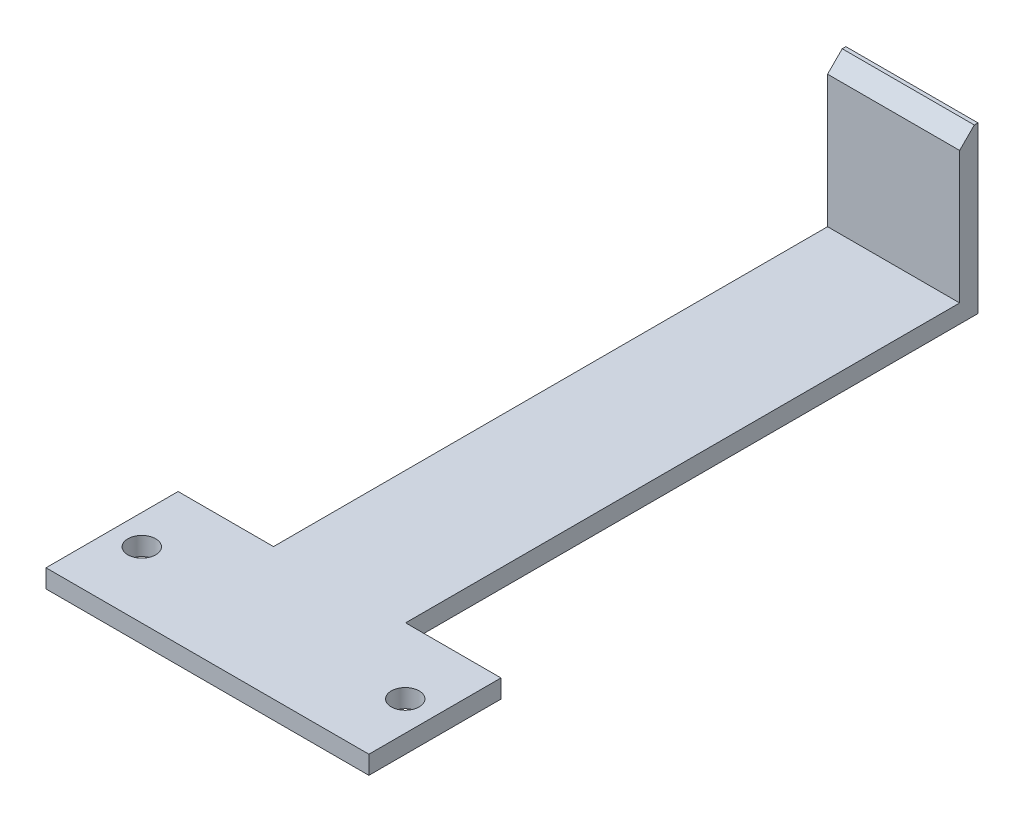
ISO-10303-21;
HEADER;
FILE_DESCRIPTION(('STEP AP214'),'2;1');
FILE_NAME('part.step','',(''),(''),'','','');
FILE_SCHEMA(('AUTOMOTIVE_DESIGN { 1 0 10303 214 1 1 1 1 }'));
ENDSEC;
DATA;
#1=APPLICATION_CONTEXT('core data for automotive mechanical design processes');
#2=APPLICATION_PROTOCOL_DEFINITION('international standard','automotive_design',2000,#1);
#3=PRODUCT_CONTEXT('',#1,'mechanical');
#4=PRODUCT('Part','Part','',(#3));
#5=PRODUCT_RELATED_PRODUCT_CATEGORY('part','',(#4));
#6=PRODUCT_DEFINITION_FORMATION('','',#4);
#7=PRODUCT_DEFINITION_CONTEXT('part definition',#1,'design');
#8=PRODUCT_DEFINITION('design','',#6,#7);
#9=PRODUCT_DEFINITION_SHAPE('','',#8);
#10=(LENGTH_UNIT() NAMED_UNIT(*) SI_UNIT(.MILLI.,.METRE.));
#11=(NAMED_UNIT(*) PLANE_ANGLE_UNIT() SI_UNIT($,.RADIAN.));
#12=(NAMED_UNIT(*) SI_UNIT($,.STERADIAN.) SOLID_ANGLE_UNIT());
#13=UNCERTAINTY_MEASURE_WITH_UNIT(LENGTH_MEASURE(1.E-05),#10,'distance_accuracy_value','');
#14=(GEOMETRIC_REPRESENTATION_CONTEXT(3) GLOBAL_UNCERTAINTY_ASSIGNED_CONTEXT((#13)) GLOBAL_UNIT_ASSIGNED_CONTEXT((#10,
#11,#12)) REPRESENTATION_CONTEXT('',''));
#15=CARTESIAN_POINT('',(0.,0.,0.));
#16=DIRECTION('',(0.,0.,1.));
#17=DIRECTION('',(1.,0.,0.));
#18=AXIS2_PLACEMENT_3D('',#15,#16,#17);
#19=CARTESIAN_POINT('',(-11.43,3.175,0.));
#20=DIRECTION('',(-1.,0.,0.));
#21=DIRECTION('',(0.,0.,1.));
#22=AXIS2_PLACEMENT_3D('',#19,#20,#21);
#23=PLANE('',#22);
#24=DIRECTION('',(0.,-1.,0.));
#25=VECTOR('',#24,1.);
#26=CARTESIAN_POINT('',(-11.43,28.575,-107.315));
#27=LINE('',#26,#25);
#28=CARTESIAN_POINT('',(-11.43,26.035,-107.315));
#29=VERTEX_POINT('',#28);
#30=CARTESIAN_POINT('',(-11.43,3.175,-107.315));
#31=VERTEX_POINT('',#30);
#32=EDGE_CURVE('E165',#29,#31,#27,.T.);
#33=ORIENTED_EDGE('',*,*,#32,.F.);
#34=DIRECTION('',(0.,0.707106781186551,-0.707106781186544));
#35=VECTOR('',#34,1.);
#36=CARTESIAN_POINT('',(-11.43,-39.0525000000001,-42.2275000000006));
#37=LINE('',#36,#35);
#38=CARTESIAN_POINT('',(-11.43,28.575,-109.855));
#39=VERTEX_POINT('',#38);
#40=EDGE_CURVE('E13',#29,#39,#37,.T.);
#41=ORIENTED_EDGE('',*,*,#40,.T.);
#42=DIRECTION('',(0.,0.,1.));
#43=VECTOR('',#42,1.);
#44=CARTESIAN_POINT('',(-11.43,28.575,-110.49));
#45=LINE('',#44,#43);
#46=CARTESIAN_POINT('',(-11.43,28.575,-110.49));
#47=VERTEX_POINT('',#46);
#48=EDGE_CURVE('E145',#47,#39,#45,.T.);
#49=ORIENTED_EDGE('',*,*,#48,.F.);
#50=DIRECTION('',(0.,-1.,0.));
#51=VECTOR('',#50,1.);
#52=CARTESIAN_POINT('',(-11.43,3.175,-110.49));
#53=LINE('',#52,#51);
#54=CARTESIAN_POINT('',(-11.43,0.,-110.49));
#55=VERTEX_POINT('',#54);
#56=EDGE_CURVE('E158',#47,#55,#53,.T.);
#57=ORIENTED_EDGE('',*,*,#56,.T.);
#58=DIRECTION('',(0.,0.,-1.));
#59=VECTOR('',#58,1.);
#60=CARTESIAN_POINT('',(-11.43,0.,0.));
#61=LINE('',#60,#59);
#62=CARTESIAN_POINT('',(-11.43,0.,-11.43));
#63=VERTEX_POINT('',#62);
#64=EDGE_CURVE('E175',#63,#55,#61,.T.);
#65=ORIENTED_EDGE('',*,*,#64,.F.);
#66=DIRECTION('',(0.,-1.,0.));
#67=VECTOR('',#66,1.);
#68=CARTESIAN_POINT('',(-11.43,3.175,-11.43));
#69=LINE('',#68,#67);
#70=CARTESIAN_POINT('',(-11.43,3.175,-11.43));
#71=VERTEX_POINT('',#70);
#72=EDGE_CURVE('E256',#71,#63,#69,.T.);
#73=ORIENTED_EDGE('',*,*,#72,.F.);
#74=DIRECTION('',(0.,0.,-1.));
#75=VECTOR('',#74,1.);
#76=CARTESIAN_POINT('',(-11.43,3.175,0.));
#77=LINE('',#76,#75);
#78=EDGE_CURVE('E176',#71,#31,#77,.T.);
#79=ORIENTED_EDGE('',*,*,#78,.T.);
#80=EDGE_LOOP('',(#33,#41,#49,#57,#65,#73,#79));
#81=FACE_BOUND('',#80,.T.);
#82=ADVANCED_FACE('F52',(#81),#23,.T.);
#83=CARTESIAN_POINT('',(0.,3.175,-11.43));
#84=DIRECTION('',(0.,0.,1.));
#85=DIRECTION('',(1.,0.,0.));
#86=AXIS2_PLACEMENT_3D('',#83,#84,#85);
#87=PLANE('',#86);
#88=DIRECTION('',(-1.,0.,0.));
#89=VECTOR('',#88,1.);
#90=CARTESIAN_POINT('',(0.,0.,-11.43));
#91=LINE('',#90,#89);
#92=CARTESIAN_POINT('',(-27.94,0.,-11.43));
#93=VERTEX_POINT('',#92);
#94=EDGE_CURVE('E211',#63,#93,#91,.T.);
#95=ORIENTED_EDGE('',*,*,#94,.T.);
#96=DIRECTION('',(0.,-1.,0.));
#97=VECTOR('',#96,1.);
#98=CARTESIAN_POINT('',(-27.94,3.175,-11.43));
#99=LINE('',#98,#97);
#100=CARTESIAN_POINT('',(-27.94,3.175,-11.43));
#101=VERTEX_POINT('',#100);
#102=EDGE_CURVE('E253',#101,#93,#99,.T.);
#103=ORIENTED_EDGE('',*,*,#102,.F.);
#104=DIRECTION('',(-1.,0.,0.));
#105=VECTOR('',#104,1.);
#106=CARTESIAN_POINT('',(0.,3.175,-11.43));
#107=LINE('',#106,#105);
#108=EDGE_CURVE('E180',#71,#101,#107,.T.);
#109=ORIENTED_EDGE('',*,*,#108,.F.);
#110=ORIENTED_EDGE('',*,*,#72,.T.);
#111=EDGE_LOOP('',(#95,#103,#109,#110));
#112=FACE_BOUND('',#111,.T.);
#113=ADVANCED_FACE('F290',(#112),#87,.F.);
#114=CARTESIAN_POINT('',(-27.94,3.175,0.));
#115=DIRECTION('',(-1.,0.,0.));
#116=DIRECTION('',(0.,0.,1.));
#117=AXIS2_PLACEMENT_3D('',#114,#115,#116);
#118=PLANE('',#117);
#119=DIRECTION('',(0.,0.,-1.));
#120=VECTOR('',#119,1.);
#121=CARTESIAN_POINT('',(-27.94,0.,0.));
#122=LINE('',#121,#120);
#123=CARTESIAN_POINT('',(-27.94,0.,11.43));
#124=VERTEX_POINT('',#123);
#125=EDGE_CURVE('E215',#124,#93,#122,.T.);
#126=ORIENTED_EDGE('',*,*,#125,.F.);
#127=DIRECTION('',(0.,-1.,0.));
#128=VECTOR('',#127,1.);
#129=CARTESIAN_POINT('',(-27.94,3.175,11.43));
#130=LINE('',#129,#128);
#131=CARTESIAN_POINT('',(-27.94,3.175,11.43));
#132=VERTEX_POINT('',#131);
#133=EDGE_CURVE('E250',#132,#124,#130,.T.);
#134=ORIENTED_EDGE('',*,*,#133,.F.);
#135=DIRECTION('',(0.,0.,-1.));
#136=VECTOR('',#135,1.);
#137=CARTESIAN_POINT('',(-27.94,3.175,0.));
#138=LINE('',#137,#136);
#139=EDGE_CURVE('E184',#132,#101,#138,.T.);
#140=ORIENTED_EDGE('',*,*,#139,.T.);
#141=ORIENTED_EDGE('',*,*,#102,.T.);
#142=EDGE_LOOP('',(#126,#134,#140,#141));
#143=FACE_BOUND('',#142,.T.);
#144=ADVANCED_FACE('F294',(#143),#118,.T.);
#145=CARTESIAN_POINT('',(0.,3.175,11.43));
#146=DIRECTION('',(0.,0.,1.));
#147=DIRECTION('',(1.,0.,0.));
#148=AXIS2_PLACEMENT_3D('',#145,#146,#147);
#149=PLANE('',#148);
#150=DIRECTION('',(-1.,0.,0.));
#151=VECTOR('',#150,1.);
#152=CARTESIAN_POINT('',(0.,0.,11.43));
#153=LINE('',#152,#151);
#154=CARTESIAN_POINT('',(27.94,0.,11.43));
#155=VERTEX_POINT('',#154);
#156=EDGE_CURVE('E220',#155,#124,#153,.T.);
#157=ORIENTED_EDGE('',*,*,#156,.F.);
#158=DIRECTION('',(0.,-1.,0.));
#159=VECTOR('',#158,1.);
#160=CARTESIAN_POINT('',(27.94,3.175,11.43));
#161=LINE('',#160,#159);
#162=CARTESIAN_POINT('',(27.94,3.175,11.43));
#163=VERTEX_POINT('',#162);
#164=EDGE_CURVE('E247',#163,#155,#161,.T.);
#165=ORIENTED_EDGE('',*,*,#164,.F.);
#166=DIRECTION('',(-1.,0.,0.));
#167=VECTOR('',#166,1.);
#168=CARTESIAN_POINT('',(0.,3.175,11.43));
#169=LINE('',#168,#167);
#170=EDGE_CURVE('E189',#163,#132,#169,.T.);
#171=ORIENTED_EDGE('',*,*,#170,.T.);
#172=ORIENTED_EDGE('',*,*,#133,.T.);
#173=EDGE_LOOP('',(#157,#165,#171,#172));
#174=FACE_BOUND('',#173,.T.);
#175=ADVANCED_FACE('F300',(#174),#149,.T.);
#176=CARTESIAN_POINT('',(27.94,3.175,0.));
#177=DIRECTION('',(-1.,0.,0.));
#178=DIRECTION('',(0.,0.,1.));
#179=AXIS2_PLACEMENT_3D('',#176,#177,#178);
#180=PLANE('',#179);
#181=DIRECTION('',(0.,0.,-1.));
#182=VECTOR('',#181,1.);
#183=CARTESIAN_POINT('',(27.94,0.,0.));
#184=LINE('',#183,#182);
#185=CARTESIAN_POINT('',(27.94,0.,-11.43));
#186=VERTEX_POINT('',#185);
#187=EDGE_CURVE('E224',#155,#186,#184,.T.);
#188=ORIENTED_EDGE('',*,*,#187,.T.);
#189=DIRECTION('',(0.,-1.,0.));
#190=VECTOR('',#189,1.);
#191=CARTESIAN_POINT('',(27.94,3.175,-11.43));
#192=LINE('',#191,#190);
#193=CARTESIAN_POINT('',(27.94,3.175,-11.43));
#194=VERTEX_POINT('',#193);
#195=EDGE_CURVE('E243',#194,#186,#192,.T.);
#196=ORIENTED_EDGE('',*,*,#195,.F.);
#197=DIRECTION('',(0.,0.,-1.));
#198=VECTOR('',#197,1.);
#199=CARTESIAN_POINT('',(27.94,3.175,0.));
#200=LINE('',#199,#198);
#201=EDGE_CURVE('E193',#163,#194,#200,.T.);
#202=ORIENTED_EDGE('',*,*,#201,.F.);
#203=ORIENTED_EDGE('',*,*,#164,.T.);
#204=EDGE_LOOP('',(#188,#196,#202,#203));
#205=FACE_BOUND('',#204,.T.);
#206=ADVANCED_FACE('F304',(#205),#180,.F.);
#207=CARTESIAN_POINT('',(11.43,0.,-11.43));
#208=VERTEX_POINT('',#207);
#209=EDGE_CURVE('E216',#186,#208,#91,.T.);
#210=ORIENTED_EDGE('',*,*,#209,.T.);
#211=DIRECTION('',(0.,-1.,0.));
#212=VECTOR('',#211,1.);
#213=CARTESIAN_POINT('',(11.43,3.175,-11.43));
#214=LINE('',#213,#212);
#215=CARTESIAN_POINT('',(11.43,3.175,-11.43));
#216=VERTEX_POINT('',#215);
#217=EDGE_CURVE('E157',#216,#208,#214,.T.);
#218=ORIENTED_EDGE('',*,*,#217,.F.);
#219=EDGE_CURVE('E185',#194,#216,#107,.T.);
#220=ORIENTED_EDGE('',*,*,#219,.F.);
#221=ORIENTED_EDGE('',*,*,#195,.T.);
#222=EDGE_LOOP('',(#210,#218,#220,#221));
#223=FACE_BOUND('',#222,.T.);
#224=ADVANCED_FACE('F268',(#223),#87,.F.);
#225=CARTESIAN_POINT('',(11.43,3.175,0.));
#226=DIRECTION('',(-1.,0.,0.));
#227=DIRECTION('',(0.,0.,1.));
#228=AXIS2_PLACEMENT_3D('',#225,#226,#227);
#229=PLANE('',#228);
#230=DIRECTION('',(0.,0.,-1.));
#231=VECTOR('',#230,1.);
#232=CARTESIAN_POINT('',(11.43,28.575,-110.49));
#233=LINE('',#232,#231);
#234=CARTESIAN_POINT('',(11.43,28.575,-109.855));
#235=VERTEX_POINT('',#234);
#236=CARTESIAN_POINT('',(11.43,28.575,-110.49));
#237=VERTEX_POINT('',#236);
#238=EDGE_CURVE('E135',#235,#237,#233,.T.);
#239=ORIENTED_EDGE('',*,*,#238,.F.);
#240=DIRECTION('',(0.,-0.707106781186551,0.707106781186544));
#241=VECTOR('',#240,1.);
#242=CARTESIAN_POINT('',(11.43,28.575,-109.855));
#243=LINE('',#242,#241);
#244=CARTESIAN_POINT('',(11.43,26.035,-107.315));
#245=VERTEX_POINT('',#244);
#246=EDGE_CURVE('E76',#235,#245,#243,.T.);
#247=ORIENTED_EDGE('',*,*,#246,.T.);
#248=DIRECTION('',(0.,-1.,0.));
#249=VECTOR('',#248,1.);
#250=CARTESIAN_POINT('',(11.43,28.575,-107.315));
#251=LINE('',#250,#249);
#252=CARTESIAN_POINT('',(11.43,3.175,-107.315));
#253=VERTEX_POINT('',#252);
#254=EDGE_CURVE('E162',#245,#253,#251,.T.);
#255=ORIENTED_EDGE('',*,*,#254,.T.);
#256=DIRECTION('',(0.,0.,-1.));
#257=VECTOR('',#256,1.);
#258=CARTESIAN_POINT('',(11.43,3.175,0.));
#259=LINE('',#258,#257);
#260=EDGE_CURVE('E196',#216,#253,#259,.T.);
#261=ORIENTED_EDGE('',*,*,#260,.F.);
#262=ORIENTED_EDGE('',*,*,#217,.T.);
#263=DIRECTION('',(0.,0.,-1.));
#264=VECTOR('',#263,1.);
#265=CARTESIAN_POINT('',(11.43,0.,0.));
#266=LINE('',#265,#264);
#267=CARTESIAN_POINT('',(11.43,0.,-110.49));
#268=VERTEX_POINT('',#267);
#269=EDGE_CURVE('E152',#208,#268,#266,.T.);
#270=ORIENTED_EDGE('',*,*,#269,.T.);
#271=DIRECTION('',(0.,-1.,0.));
#272=VECTOR('',#271,1.);
#273=CARTESIAN_POINT('',(11.43,3.175,-110.49));
#274=LINE('',#273,#272);
#275=EDGE_CURVE('E148',#237,#268,#274,.T.);
#276=ORIENTED_EDGE('',*,*,#275,.F.);
#277=EDGE_LOOP('',(#239,#247,#255,#261,#262,#270,#276));
#278=FACE_BOUND('',#277,.T.);
#279=ADVANCED_FACE('F149',(#278),#229,.F.);
#280=CARTESIAN_POINT('',(22.7965,3.175,0.));
#281=DIRECTION('',(0.,-1.,0.));
#282=DIRECTION('',(0.,0.,-1.));
#283=AXIS2_PLACEMENT_3D('',#280,#281,#282);
#284=CYLINDRICAL_SURFACE('',#283,2.413);
#285=CARTESIAN_POINT('',(22.7965,3.175,0.));
#286=DIRECTION('',(0.,1.,0.));
#287=DIRECTION('',(0.,0.,1.));
#288=AXIS2_PLACEMENT_3D('',#285,#286,#287);
#289=CIRCLE('',#288,2.413);
#290=CARTESIAN_POINT('',(22.7965,3.175,2.413));
#291=VERTEX_POINT('',#290);
#292=EDGE_CURVE('E200',#291,#291,#289,.T.);
#293=ORIENTED_EDGE('',*,*,#292,.T.);
#294=EDGE_LOOP('',(#293));
#295=FACE_BOUND('',#294,.T.);
#296=CARTESIAN_POINT('',(22.7965,0.,0.));
#297=DIRECTION('',(0.,1.,0.));
#298=DIRECTION('',(0.,0.,1.));
#299=AXIS2_PLACEMENT_3D('',#296,#297,#298);
#300=CIRCLE('',#299,2.413);
#301=CARTESIAN_POINT('',(22.7965,0.,2.413));
#302=VERTEX_POINT('',#301);
#303=EDGE_CURVE('E232',#302,#302,#300,.T.);
#304=ORIENTED_EDGE('',*,*,#303,.F.);
#305=EDGE_LOOP('',(#304));
#306=FACE_BOUND('',#305,.T.);
#307=ADVANCED_FACE('F312',(#295,#306),#284,.F.);
#308=CARTESIAN_POINT('',(0.,3.175,-110.49));
#309=DIRECTION('',(0.,0.,1.));
#310=DIRECTION('',(1.,0.,0.));
#311=AXIS2_PLACEMENT_3D('',#308,#309,#310);
#312=PLANE('',#311);
#313=DIRECTION('',(-1.,0.,0.));
#314=VECTOR('',#313,1.);
#315=CARTESIAN_POINT('',(0.,0.,-110.49));
#316=LINE('',#315,#314);
#317=EDGE_CURVE('E229',#268,#55,#316,.T.);
#318=ORIENTED_EDGE('',*,*,#317,.T.);
#319=ORIENTED_EDGE('',*,*,#56,.F.);
#320=DIRECTION('',(-1.,0.,0.));
#321=VECTOR('',#320,1.);
#322=CARTESIAN_POINT('',(-11.43,28.575,-110.49));
#323=LINE('',#322,#321);
#324=EDGE_CURVE('E140',#237,#47,#323,.T.);
#325=ORIENTED_EDGE('',*,*,#324,.F.);
#326=ORIENTED_EDGE('',*,*,#275,.T.);
#327=EDGE_LOOP('',(#318,#319,#325,#326));
#328=FACE_BOUND('',#327,.T.);
#329=ADVANCED_FACE('F160',(#328),#312,.F.);
#330=CARTESIAN_POINT('',(-22.7965,3.175,0.));
#331=DIRECTION('',(0.,-1.,0.));
#332=DIRECTION('',(0.,0.,-1.));
#333=AXIS2_PLACEMENT_3D('',#330,#331,#332);
#334=CYLINDRICAL_SURFACE('',#333,2.413);
#335=CARTESIAN_POINT('',(-22.7965,3.175,0.));
#336=DIRECTION('',(0.,1.,0.));
#337=DIRECTION('',(0.,0.,1.));
#338=AXIS2_PLACEMENT_3D('',#335,#336,#337);
#339=CIRCLE('',#338,2.413);
#340=CARTESIAN_POINT('',(-22.7965,3.175,2.413));
#341=VERTEX_POINT('',#340);
#342=EDGE_CURVE('E204',#341,#341,#339,.T.);
#343=ORIENTED_EDGE('',*,*,#342,.T.);
#344=EDGE_LOOP('',(#343));
#345=FACE_BOUND('',#344,.T.);
#346=CARTESIAN_POINT('',(-22.7965,0.,0.));
#347=DIRECTION('',(0.,1.,0.));
#348=DIRECTION('',(0.,0.,1.));
#349=AXIS2_PLACEMENT_3D('',#346,#347,#348);
#350=CIRCLE('',#349,2.413);
#351=CARTESIAN_POINT('',(-22.7965,0.,2.413));
#352=VERTEX_POINT('',#351);
#353=EDGE_CURVE('E181',#352,#352,#350,.T.);
#354=ORIENTED_EDGE('',*,*,#353,.F.);
#355=EDGE_LOOP('',(#354));
#356=FACE_BOUND('',#355,.T.);
#357=ADVANCED_FACE('F315',(#345,#356),#334,.F.);
#358=CARTESIAN_POINT('',(0.,3.175,0.));
#359=DIRECTION('',(0.,1.,0.));
#360=DIRECTION('',(0.,0.,1.));
#361=AXIS2_PLACEMENT_3D('',#358,#359,#360);
#362=PLANE('',#361);
#363=DIRECTION('',(1.,0.,0.));
#364=VECTOR('',#363,1.);
#365=CARTESIAN_POINT('',(-11.43,3.175,-107.315));
#366=LINE('',#365,#364);
#367=EDGE_CURVE('E169',#31,#253,#366,.T.);
#368=ORIENTED_EDGE('',*,*,#367,.F.);
#369=ORIENTED_EDGE('',*,*,#78,.F.);
#370=ORIENTED_EDGE('',*,*,#108,.T.);
#371=ORIENTED_EDGE('',*,*,#139,.F.);
#372=ORIENTED_EDGE('',*,*,#170,.F.);
#373=ORIENTED_EDGE('',*,*,#201,.T.);
#374=ORIENTED_EDGE('',*,*,#219,.T.);
#375=ORIENTED_EDGE('',*,*,#260,.T.);
#376=EDGE_LOOP('',(#368,#369,#370,#371,#372,#373,#374,#375));
#377=FACE_BOUND('',#376,.T.);
#378=ORIENTED_EDGE('',*,*,#292,.F.);
#379=EDGE_LOOP('',(#378));
#380=FACE_BOUND('',#379,.T.);
#381=ORIENTED_EDGE('',*,*,#342,.F.);
#382=EDGE_LOOP('',(#381));
#383=FACE_BOUND('',#382,.T.);
#384=ADVANCED_FACE('F321',(#377,#380,#383),#362,.T.);
#385=CARTESIAN_POINT('',(0.,0.,0.));
#386=DIRECTION('',(0.,1.,0.));
#387=DIRECTION('',(0.,0.,1.));
#388=AXIS2_PLACEMENT_3D('',#385,#386,#387);
#389=PLANE('',#388);
#390=ORIENTED_EDGE('',*,*,#64,.T.);
#391=ORIENTED_EDGE('',*,*,#317,.F.);
#392=ORIENTED_EDGE('',*,*,#269,.F.);
#393=ORIENTED_EDGE('',*,*,#209,.F.);
#394=ORIENTED_EDGE('',*,*,#187,.F.);
#395=ORIENTED_EDGE('',*,*,#156,.T.);
#396=ORIENTED_EDGE('',*,*,#125,.T.);
#397=ORIENTED_EDGE('',*,*,#94,.F.);
#398=EDGE_LOOP('',(#390,#391,#392,#393,#394,#395,#396,#397));
#399=FACE_BOUND('',#398,.T.);
#400=ORIENTED_EDGE('',*,*,#303,.T.);
#401=EDGE_LOOP('',(#400));
#402=FACE_BOUND('',#401,.T.);
#403=ORIENTED_EDGE('',*,*,#353,.T.);
#404=EDGE_LOOP('',(#403));
#405=FACE_BOUND('',#404,.T.);
#406=ADVANCED_FACE('F274',(#399,#402,#405),#389,.F.);
#407=CARTESIAN_POINT('',(-11.43,28.575,-107.315));
#408=DIRECTION('',(0.,0.,-1.));
#409=DIRECTION('',(-1.,0.,0.));
#410=AXIS2_PLACEMENT_3D('',#407,#408,#409);
#411=PLANE('',#410);
#412=ORIENTED_EDGE('',*,*,#254,.F.);
#413=DIRECTION('',(-1.,0.,0.));
#414=VECTOR('',#413,1.);
#415=CARTESIAN_POINT('',(-11.43,26.035,-107.315));
#416=LINE('',#415,#414);
#417=EDGE_CURVE('E62',#245,#29,#416,.T.);
#418=ORIENTED_EDGE('',*,*,#417,.T.);
#419=ORIENTED_EDGE('',*,*,#32,.T.);
#420=ORIENTED_EDGE('',*,*,#367,.T.);
#421=EDGE_LOOP('',(#412,#418,#419,#420));
#422=FACE_BOUND('',#421,.T.);
#423=ADVANCED_FACE('F287',(#422),#411,.F.);
#424=CARTESIAN_POINT('',(0.,28.575,0.));
#425=DIRECTION('',(0.,1.,0.));
#426=DIRECTION('',(0.,0.,1.));
#427=AXIS2_PLACEMENT_3D('',#424,#425,#426);
#428=PLANE('',#427);
#429=ORIENTED_EDGE('',*,*,#48,.T.);
#430=DIRECTION('',(1.,0.,0.));
#431=VECTOR('',#430,1.);
#432=CARTESIAN_POINT('',(11.43,28.575,-109.855));
#433=LINE('',#432,#431);
#434=EDGE_CURVE('E143',#39,#235,#433,.T.);
#435=ORIENTED_EDGE('',*,*,#434,.T.);
#436=ORIENTED_EDGE('',*,*,#238,.T.);
#437=ORIENTED_EDGE('',*,*,#324,.T.);
#438=EDGE_LOOP('',(#429,#435,#436,#437));
#439=FACE_BOUND('',#438,.T.);
#440=ADVANCED_FACE('F138',(#439),#428,.T.);
#441=CARTESIAN_POINT('',(0.,28.575,-109.855));
#442=DIRECTION('',(0.,0.707106781186544,0.707106781186551));
#443=DIRECTION('',(-1.,0.,0.));
#444=AXIS2_PLACEMENT_3D('',#441,#442,#443);
#445=PLANE('',#444);
#446=ORIENTED_EDGE('',*,*,#40,.F.);
#447=ORIENTED_EDGE('',*,*,#417,.F.);
#448=ORIENTED_EDGE('',*,*,#246,.F.);
#449=ORIENTED_EDGE('',*,*,#434,.F.);
#450=EDGE_LOOP('',(#446,#447,#448,#449));
#451=FACE_BOUND('',#450,.T.);
#452=ADVANCED_FACE('F55',(#451),#445,.T.);
#453=CLOSED_SHELL('',(#82,#113,#144,#175,#206,#224,#279,#307,#329,#357,#384,#406,#423,#440,#452));
#454=MANIFOLD_SOLID_BREP('B2',#453);
#455=ADVANCED_BREP_SHAPE_REPRESENTATION('',(#18,#454),#14);
#456=SHAPE_DEFINITION_REPRESENTATION(#9,#455);
ENDSEC;
END-ISO-10303-21;
